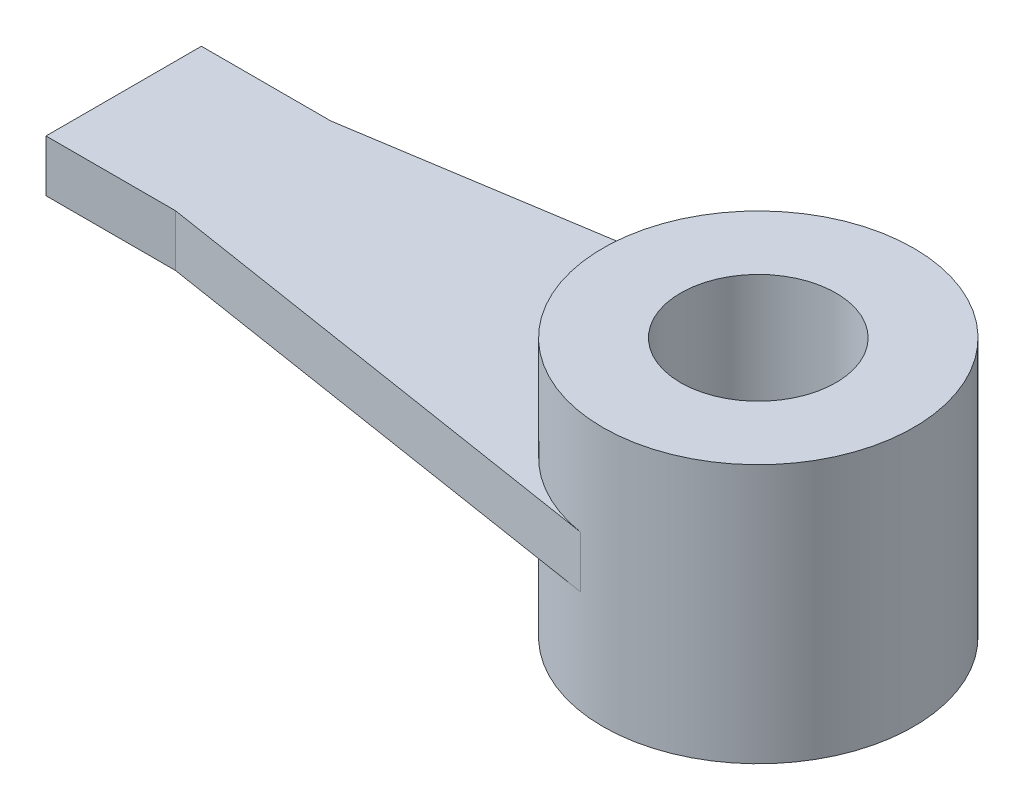
ISO-10303-21;
HEADER;
FILE_DESCRIPTION(('STEP AP214'),'2;1');
FILE_NAME('part.step','',(''),(''),'','','');
FILE_SCHEMA(('AUTOMOTIVE_DESIGN { 1 0 10303 214 1 1 1 1 }'));
ENDSEC;
DATA;
#1=APPLICATION_CONTEXT('core data for automotive mechanical design processes');
#2=APPLICATION_PROTOCOL_DEFINITION('international standard','automotive_design',2000,#1);
#3=PRODUCT_CONTEXT('',#1,'mechanical');
#4=PRODUCT('Part','Part','',(#3));
#5=PRODUCT_RELATED_PRODUCT_CATEGORY('part','',(#4));
#6=PRODUCT_DEFINITION_FORMATION('','',#4);
#7=PRODUCT_DEFINITION_CONTEXT('part definition',#1,'design');
#8=PRODUCT_DEFINITION('design','',#6,#7);
#9=PRODUCT_DEFINITION_SHAPE('','',#8);
#10=(LENGTH_UNIT() NAMED_UNIT(*) SI_UNIT(.MILLI.,.METRE.));
#11=(NAMED_UNIT(*) PLANE_ANGLE_UNIT() SI_UNIT($,.RADIAN.));
#12=(NAMED_UNIT(*) SI_UNIT($,.STERADIAN.) SOLID_ANGLE_UNIT());
#13=UNCERTAINTY_MEASURE_WITH_UNIT(LENGTH_MEASURE(1.E-05),#10,'distance_accuracy_value','');
#14=(GEOMETRIC_REPRESENTATION_CONTEXT(3) GLOBAL_UNCERTAINTY_ASSIGNED_CONTEXT((#13)) GLOBAL_UNIT_ASSIGNED_CONTEXT((#10,
#11,#12)) REPRESENTATION_CONTEXT('',''));
#15=CARTESIAN_POINT('',(0.,0.,0.));
#16=DIRECTION('',(0.,0.,1.));
#17=DIRECTION('',(1.,0.,0.));
#18=AXIS2_PLACEMENT_3D('',#15,#16,#17);
#19=CARTESIAN_POINT('',(0.,25.,0.));
#20=DIRECTION('',(0.,1.,0.));
#21=DIRECTION('',(0.,0.,1.));
#22=AXIS2_PLACEMENT_3D('',#19,#20,#21);
#23=PLANE('',#22);
#24=CARTESIAN_POINT('',(0.,25.,0.));
#25=DIRECTION('',(0.,1.,0.));
#26=DIRECTION('',(0.,0.,1.));
#27=AXIS2_PLACEMENT_3D('',#24,#25,#26);
#28=CIRCLE('',#27,30.);
#29=CARTESIAN_POINT('',(0.,25.,30.));
#30=VERTEX_POINT('',#29);
#31=EDGE_CURVE('E11',#30,#30,#28,.T.);
#32=ORIENTED_EDGE('',*,*,#31,.T.);
#33=EDGE_LOOP('',(#32));
#34=FACE_BOUND('',#33,.T.);
#35=CARTESIAN_POINT('',(0.,25.,0.));
#36=DIRECTION('',(0.,1.,0.));
#37=DIRECTION('',(0.,0.,1.));
#38=AXIS2_PLACEMENT_3D('',#35,#36,#37);
#39=CIRCLE('',#38,15.);
#40=CARTESIAN_POINT('',(0.,25.,15.));
#41=VERTEX_POINT('',#40);
#42=EDGE_CURVE('E111',#41,#41,#39,.T.);
#43=ORIENTED_EDGE('',*,*,#42,.F.);
#44=EDGE_LOOP('',(#43));
#45=FACE_BOUND('',#44,.T.);
#46=ADVANCED_FACE('F33',(#34,#45),#23,.T.);
#47=CARTESIAN_POINT('',(0.,-25.,0.));
#48=DIRECTION('',(0.,1.,0.));
#49=DIRECTION('',(0.,0.,1.));
#50=AXIS2_PLACEMENT_3D('',#47,#48,#49);
#51=PLANE('',#50);
#52=CARTESIAN_POINT('',(0.,-25.,0.));
#53=DIRECTION('',(0.,1.,0.));
#54=DIRECTION('',(0.,0.,1.));
#55=AXIS2_PLACEMENT_3D('',#52,#53,#54);
#56=CIRCLE('',#55,30.);
#57=CARTESIAN_POINT('',(0.,-25.,30.));
#58=VERTEX_POINT('',#57);
#59=EDGE_CURVE('E37',#58,#58,#56,.T.);
#60=ORIENTED_EDGE('',*,*,#59,.F.);
#61=EDGE_LOOP('',(#60));
#62=FACE_BOUND('',#61,.T.);
#63=CARTESIAN_POINT('',(0.,-25.,0.));
#64=DIRECTION('',(0.,1.,0.));
#65=DIRECTION('',(0.,0.,1.));
#66=AXIS2_PLACEMENT_3D('',#63,#64,#65);
#67=CIRCLE('',#66,15.);
#68=CARTESIAN_POINT('',(0.,-25.,15.));
#69=VERTEX_POINT('',#68);
#70=EDGE_CURVE('E108',#69,#69,#67,.T.);
#71=ORIENTED_EDGE('',*,*,#70,.T.);
#72=EDGE_LOOP('',(#71));
#73=FACE_BOUND('',#72,.T.);
#74=ADVANCED_FACE('F123',(#62,#73),#51,.F.);
#75=CARTESIAN_POINT('',(0.,25.,0.));
#76=DIRECTION('',(0.,-1.,0.));
#77=DIRECTION('',(0.,0.,-1.));
#78=AXIS2_PLACEMENT_3D('',#75,#76,#77);
#79=CYLINDRICAL_SURFACE('',#78,30.);
#80=DIRECTION('',(0.,-1.,0.));
#81=VECTOR('',#80,1.);
#82=CARTESIAN_POINT('',(-4.67168875625144,5.,-29.6340230843656));
#83=LINE('',#82,#81);
#84=CARTESIAN_POINT('',(-4.67168875625144,5.,-29.6340230843656));
#85=VERTEX_POINT('',#84);
#86=CARTESIAN_POINT('',(-4.67168875625144,-5.,-29.6340230843656));
#87=VERTEX_POINT('',#86);
#88=EDGE_CURVE('E53',#85,#87,#83,.T.);
#89=ORIENTED_EDGE('',*,*,#88,.F.);
#90=CARTESIAN_POINT('',(0.,5.,0.));
#91=DIRECTION('',(0.,1.,0.));
#92=DIRECTION('',(0.,0.,1.));
#93=AXIS2_PLACEMENT_3D('',#90,#91,#92);
#94=CIRCLE('',#93,30.);
#95=CARTESIAN_POINT('',(-4.67168875625144,5.,29.6340230843656));
#96=VERTEX_POINT('',#95);
#97=EDGE_CURVE('E48',#85,#96,#94,.T.);
#98=ORIENTED_EDGE('',*,*,#97,.T.);
#99=DIRECTION('',(0.,-1.,0.));
#100=VECTOR('',#99,1.);
#101=CARTESIAN_POINT('',(-4.67168875625144,5.,29.6340230843656));
#102=LINE('',#101,#100);
#103=CARTESIAN_POINT('',(-4.67168875625144,-5.,29.6340230843656));
#104=VERTEX_POINT('',#103);
#105=EDGE_CURVE('E91',#96,#104,#102,.T.);
#106=ORIENTED_EDGE('',*,*,#105,.T.);
#107=CARTESIAN_POINT('',(0.,-5.,0.));
#108=DIRECTION('',(0.,1.,0.));
#109=DIRECTION('',(0.,0.,1.));
#110=AXIS2_PLACEMENT_3D('',#107,#108,#109);
#111=CIRCLE('',#110,30.);
#112=EDGE_CURVE('E226',#87,#104,#111,.T.);
#113=ORIENTED_EDGE('',*,*,#112,.F.);
#114=EDGE_LOOP('',(#89,#98,#106,#113));
#115=FACE_BOUND('',#114,.T.);
#116=ORIENTED_EDGE('',*,*,#31,.F.);
#117=EDGE_LOOP('',(#116));
#118=FACE_BOUND('',#117,.T.);
#119=ORIENTED_EDGE('',*,*,#59,.T.);
#120=EDGE_LOOP('',(#119));
#121=FACE_BOUND('',#120,.T.);
#122=ADVANCED_FACE('F35',(#115,#118,#121),#79,.T.);
#123=CARTESIAN_POINT('',(0.,25.,0.));
#124=DIRECTION('',(0.,-1.,0.));
#125=DIRECTION('',(0.,0.,-1.));
#126=AXIS2_PLACEMENT_3D('',#123,#124,#125);
#127=CYLINDRICAL_SURFACE('',#126,15.);
#128=ORIENTED_EDGE('',*,*,#42,.T.);
#129=EDGE_LOOP('',(#128));
#130=FACE_BOUND('',#129,.T.);
#131=ORIENTED_EDGE('',*,*,#70,.F.);
#132=EDGE_LOOP('',(#131));
#133=FACE_BOUND('',#132,.T.);
#134=ADVANCED_FACE('F128',(#130,#133),#127,.F.);
#135=CARTESIAN_POINT('',(-122.5,5.,15.));
#136=DIRECTION('',(0.,0.,-1.));
#137=DIRECTION('',(-1.,0.,0.));
#138=AXIS2_PLACEMENT_3D('',#135,#136,#137);
#139=PLANE('',#138);
#140=DIRECTION('',(1.,0.,0.));
#141=VECTOR('',#140,1.);
#142=CARTESIAN_POINT('',(-122.5,-5.,15.));
#143=LINE('',#142,#141);
#144=CARTESIAN_POINT('',(-122.5,-5.,15.));
#145=VERTEX_POINT('',#144);
#146=CARTESIAN_POINT('',(-97.5,-5.,15.));
#147=VERTEX_POINT('',#146);
#148=EDGE_CURVE('E107',#145,#147,#143,.T.);
#149=ORIENTED_EDGE('',*,*,#148,.T.);
#150=DIRECTION('',(0.,-1.,0.));
#151=VECTOR('',#150,1.);
#152=CARTESIAN_POINT('',(-97.5,5.,15.));
#153=LINE('',#152,#151);
#154=CARTESIAN_POINT('',(-97.5,5.,15.));
#155=VERTEX_POINT('',#154);
#156=EDGE_CURVE('E89',#155,#147,#153,.T.);
#157=ORIENTED_EDGE('',*,*,#156,.F.);
#158=DIRECTION('',(1.,0.,0.));
#159=VECTOR('',#158,1.);
#160=CARTESIAN_POINT('',(-122.5,5.,15.));
#161=LINE('',#160,#159);
#162=CARTESIAN_POINT('',(-122.5,5.,15.));
#163=VERTEX_POINT('',#162);
#164=EDGE_CURVE('E93',#163,#155,#161,.T.);
#165=ORIENTED_EDGE('',*,*,#164,.F.);
#166=DIRECTION('',(0.,-1.,0.));
#167=VECTOR('',#166,1.);
#168=CARTESIAN_POINT('',(-122.5,5.,15.));
#169=LINE('',#168,#167);
#170=EDGE_CURVE('E238',#163,#145,#169,.T.);
#171=ORIENTED_EDGE('',*,*,#170,.T.);
#172=EDGE_LOOP('',(#149,#157,#165,#171));
#173=FACE_BOUND('',#172,.T.);
#174=ADVANCED_FACE('F105',(#173),#139,.F.);
#175=CARTESIAN_POINT('',(-97.5,5.,15.));
#176=DIRECTION('',(0.155722958541715,0.,-0.987800769478854));
#177=DIRECTION('',(-0.987800769478854,0.,-0.155722958541715));
#178=AXIS2_PLACEMENT_3D('',#175,#176,#177);
#179=PLANE('',#178);
#180=DIRECTION('',(0.987800769478854,0.,0.155722958541715));
#181=VECTOR('',#180,1.);
#182=CARTESIAN_POINT('',(-97.5,-5.,15.));
#183=LINE('',#182,#181);
#184=EDGE_CURVE('E224',#147,#104,#183,.T.);
#185=ORIENTED_EDGE('',*,*,#184,.T.);
#186=ORIENTED_EDGE('',*,*,#105,.F.);
#187=DIRECTION('',(0.987800769478854,0.,0.155722958541715));
#188=VECTOR('',#187,1.);
#189=CARTESIAN_POINT('',(-97.5,5.,15.));
#190=LINE('',#189,#188);
#191=EDGE_CURVE('E84',#155,#96,#190,.T.);
#192=ORIENTED_EDGE('',*,*,#191,.F.);
#193=ORIENTED_EDGE('',*,*,#156,.T.);
#194=EDGE_LOOP('',(#185,#186,#192,#193));
#195=FACE_BOUND('',#194,.T.);
#196=ADVANCED_FACE('F87',(#195),#179,.F.);
#197=CARTESIAN_POINT('',(-97.5,5.,-15.));
#198=DIRECTION('',(-0.155722958541715,0.,-0.987800769478854));
#199=DIRECTION('',(-0.987800769478854,0.,0.155722958541715));
#200=AXIS2_PLACEMENT_3D('',#197,#198,#199);
#201=PLANE('',#200);
#202=DIRECTION('',(0.987800769478854,0.,-0.155722958541715));
#203=VECTOR('',#202,1.);
#204=CARTESIAN_POINT('',(-97.5,-5.,-15.));
#205=LINE('',#204,#203);
#206=CARTESIAN_POINT('',(-97.5,-5.,-15.));
#207=VERTEX_POINT('',#206);
#208=EDGE_CURVE('E232',#207,#87,#205,.T.);
#209=ORIENTED_EDGE('',*,*,#208,.F.);
#210=DIRECTION('',(0.,-1.,0.));
#211=VECTOR('',#210,1.);
#212=CARTESIAN_POINT('',(-97.5,5.,-15.));
#213=LINE('',#212,#211);
#214=CARTESIAN_POINT('',(-97.5,5.,-15.));
#215=VERTEX_POINT('',#214);
#216=EDGE_CURVE('E242',#215,#207,#213,.T.);
#217=ORIENTED_EDGE('',*,*,#216,.F.);
#218=DIRECTION('',(0.987800769478854,0.,-0.155722958541715));
#219=VECTOR('',#218,1.);
#220=CARTESIAN_POINT('',(-97.5,5.,-15.));
#221=LINE('',#220,#219);
#222=EDGE_CURVE('E246',#215,#85,#221,.T.);
#223=ORIENTED_EDGE('',*,*,#222,.T.);
#224=ORIENTED_EDGE('',*,*,#88,.T.);
#225=EDGE_LOOP('',(#209,#217,#223,#224));
#226=FACE_BOUND('',#225,.T.);
#227=ADVANCED_FACE('F169',(#226),#201,.T.);
#228=CARTESIAN_POINT('',(-122.5,5.,-15.));
#229=DIRECTION('',(0.,0.,-1.));
#230=DIRECTION('',(-1.,0.,0.));
#231=AXIS2_PLACEMENT_3D('',#228,#229,#230);
#232=PLANE('',#231);
#233=DIRECTION('',(1.,0.,0.));
#234=VECTOR('',#233,1.);
#235=CARTESIAN_POINT('',(-122.5,-5.,-15.));
#236=LINE('',#235,#234);
#237=CARTESIAN_POINT('',(-122.5,-5.,-15.));
#238=VERTEX_POINT('',#237);
#239=EDGE_CURVE('E235',#238,#207,#236,.T.);
#240=ORIENTED_EDGE('',*,*,#239,.F.);
#241=DIRECTION('',(0.,-1.,0.));
#242=VECTOR('',#241,1.);
#243=CARTESIAN_POINT('',(-122.5,5.,-15.));
#244=LINE('',#243,#242);
#245=CARTESIAN_POINT('',(-122.5,5.,-15.));
#246=VERTEX_POINT('',#245);
#247=EDGE_CURVE('E240',#246,#238,#244,.T.);
#248=ORIENTED_EDGE('',*,*,#247,.F.);
#249=DIRECTION('',(1.,0.,0.));
#250=VECTOR('',#249,1.);
#251=CARTESIAN_POINT('',(-122.5,5.,-15.));
#252=LINE('',#251,#250);
#253=EDGE_CURVE('E248',#246,#215,#252,.T.);
#254=ORIENTED_EDGE('',*,*,#253,.T.);
#255=ORIENTED_EDGE('',*,*,#216,.T.);
#256=EDGE_LOOP('',(#240,#248,#254,#255));
#257=FACE_BOUND('',#256,.T.);
#258=ADVANCED_FACE('F178',(#257),#232,.T.);
#259=CARTESIAN_POINT('',(-122.5,5.,-15.));
#260=DIRECTION('',(1.,0.,0.));
#261=DIRECTION('',(0.,0.,-1.));
#262=AXIS2_PLACEMENT_3D('',#259,#260,#261);
#263=PLANE('',#262);
#264=DIRECTION('',(0.,0.,1.));
#265=VECTOR('',#264,1.);
#266=CARTESIAN_POINT('',(-122.5,-5.,-15.));
#267=LINE('',#266,#265);
#268=EDGE_CURVE('E103',#238,#145,#267,.T.);
#269=ORIENTED_EDGE('',*,*,#268,.T.);
#270=ORIENTED_EDGE('',*,*,#170,.F.);
#271=DIRECTION('',(0.,0.,1.));
#272=VECTOR('',#271,1.);
#273=CARTESIAN_POINT('',(-122.5,5.,-15.));
#274=LINE('',#273,#272);
#275=EDGE_CURVE('E99',#246,#163,#274,.T.);
#276=ORIENTED_EDGE('',*,*,#275,.F.);
#277=ORIENTED_EDGE('',*,*,#247,.T.);
#278=EDGE_LOOP('',(#269,#270,#276,#277));
#279=FACE_BOUND('',#278,.T.);
#280=ADVANCED_FACE('F188',(#279),#263,.F.);
#281=CARTESIAN_POINT('',(0.,5.,0.));
#282=DIRECTION('',(0.,1.,0.));
#283=DIRECTION('',(0.,0.,1.));
#284=AXIS2_PLACEMENT_3D('',#281,#282,#283);
#285=PLANE('',#284);
#286=ORIENTED_EDGE('',*,*,#164,.T.);
#287=ORIENTED_EDGE('',*,*,#191,.T.);
#288=ORIENTED_EDGE('',*,*,#97,.F.);
#289=ORIENTED_EDGE('',*,*,#222,.F.);
#290=ORIENTED_EDGE('',*,*,#253,.F.);
#291=ORIENTED_EDGE('',*,*,#275,.T.);
#292=EDGE_LOOP('',(#286,#287,#288,#289,#290,#291));
#293=FACE_BOUND('',#292,.T.);
#294=ADVANCED_FACE('F96',(#293),#285,.T.);
#295=CARTESIAN_POINT('',(0.,-5.,0.));
#296=DIRECTION('',(0.,1.,0.));
#297=DIRECTION('',(0.,0.,1.));
#298=AXIS2_PLACEMENT_3D('',#295,#296,#297);
#299=PLANE('',#298);
#300=ORIENTED_EDGE('',*,*,#148,.F.);
#301=ORIENTED_EDGE('',*,*,#268,.F.);
#302=ORIENTED_EDGE('',*,*,#239,.T.);
#303=ORIENTED_EDGE('',*,*,#208,.T.);
#304=ORIENTED_EDGE('',*,*,#112,.T.);
#305=ORIENTED_EDGE('',*,*,#184,.F.);
#306=EDGE_LOOP('',(#300,#301,#302,#303,#304,#305));
#307=FACE_BOUND('',#306,.T.);
#308=ADVANCED_FACE('F207',(#307),#299,.F.);
#309=CLOSED_SHELL('',(#46,#74,#122,#134,#174,#196,#227,#258,#280,#294,#308));
#310=MANIFOLD_SOLID_BREP('B2',#309);
#311=ADVANCED_BREP_SHAPE_REPRESENTATION('',(#18,#310),#14);
#312=SHAPE_DEFINITION_REPRESENTATION(#9,#311);
ENDSEC;
END-ISO-10303-21;
